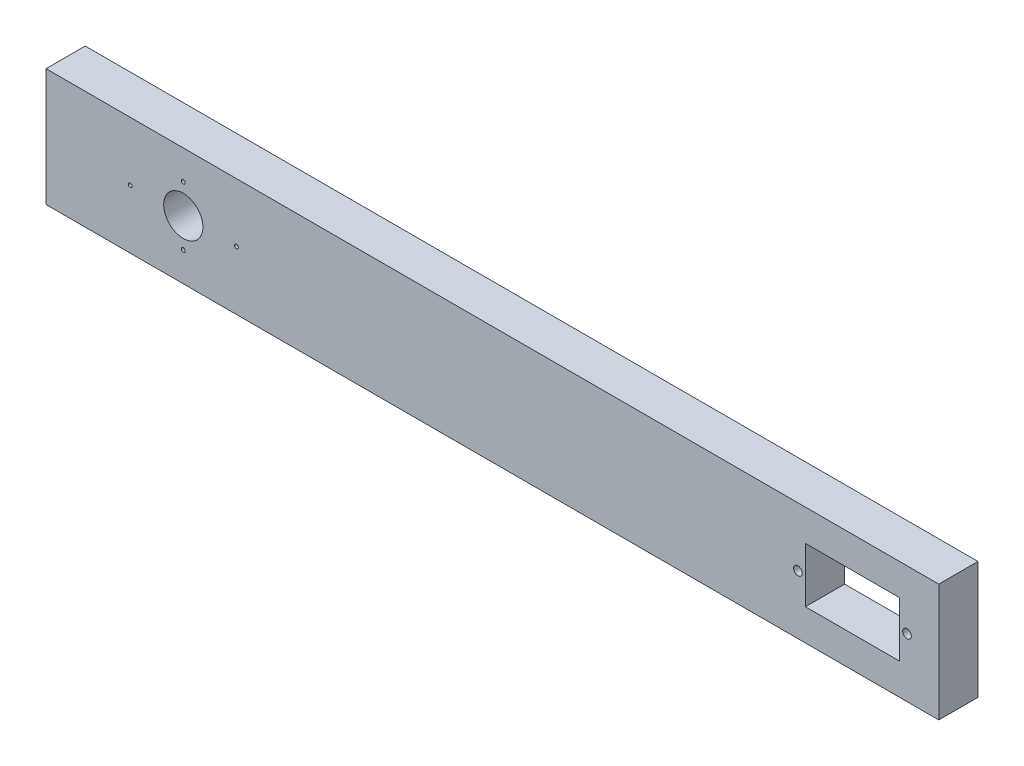
ISO-10303-21;
HEADER;
FILE_DESCRIPTION(('STEP AP214'),'2;1');
FILE_NAME('part.step','',(''),(''),'','','');
FILE_SCHEMA(('AUTOMOTIVE_DESIGN { 1 0 10303 214 1 1 1 1 }'));
ENDSEC;
DATA;
#1=APPLICATION_CONTEXT('core data for automotive mechanical design processes');
#2=APPLICATION_PROTOCOL_DEFINITION('international standard','automotive_design',2000,#1);
#3=PRODUCT_CONTEXT('',#1,'mechanical');
#4=PRODUCT('Part','Part','',(#3));
#5=PRODUCT_RELATED_PRODUCT_CATEGORY('part','',(#4));
#6=PRODUCT_DEFINITION_FORMATION('','',#4);
#7=PRODUCT_DEFINITION_CONTEXT('part definition',#1,'design');
#8=PRODUCT_DEFINITION('design','',#6,#7);
#9=PRODUCT_DEFINITION_SHAPE('','',#8);
#10=(LENGTH_UNIT() NAMED_UNIT(*) SI_UNIT(.MILLI.,.METRE.));
#11=(NAMED_UNIT(*) PLANE_ANGLE_UNIT() SI_UNIT($,.RADIAN.));
#12=(NAMED_UNIT(*) SI_UNIT($,.STERADIAN.) SOLID_ANGLE_UNIT());
#13=UNCERTAINTY_MEASURE_WITH_UNIT(LENGTH_MEASURE(1.E-05),#10,'distance_accuracy_value','');
#14=(GEOMETRIC_REPRESENTATION_CONTEXT(3) GLOBAL_UNCERTAINTY_ASSIGNED_CONTEXT((#13)) GLOBAL_UNIT_ASSIGNED_CONTEXT((#10,
#11,#12)) REPRESENTATION_CONTEXT('',''));
#15=CARTESIAN_POINT('',(0.,0.,0.));
#16=DIRECTION('',(0.,0.,1.));
#17=DIRECTION('',(1.,0.,0.));
#18=AXIS2_PLACEMENT_3D('',#15,#16,#17);
#19=CARTESIAN_POINT('',(0.,22.,10.));
#20=DIRECTION('',(0.,1.,0.));
#21=DIRECTION('',(-1.,0.,0.));
#22=AXIS2_PLACEMENT_3D('',#19,#20,#21);
#23=PLANE('',#22);
#24=DIRECTION('',(1.,0.,0.));
#25=VECTOR('',#24,1.);
#26=CARTESIAN_POINT('',(0.,22.,0.));
#27=LINE('',#26,#25);
#28=CARTESIAN_POINT('',(193.6,22.,0.));
#29=VERTEX_POINT('',#28);
#30=CARTESIAN_POINT('',(217.6,22.,0.));
#31=VERTEX_POINT('',#30);
#32=EDGE_CURVE('E166',#29,#31,#27,.T.);
#33=ORIENTED_EDGE('',*,*,#32,.T.);
#34=DIRECTION('',(0.,0.,-1.));
#35=VECTOR('',#34,1.);
#36=CARTESIAN_POINT('',(217.6,22.,10.));
#37=LINE('',#36,#35);
#38=CARTESIAN_POINT('',(217.6,22.,10.));
#39=VERTEX_POINT('',#38);
#40=EDGE_CURVE('E11',#39,#31,#37,.T.);
#41=ORIENTED_EDGE('',*,*,#40,.F.);
#42=DIRECTION('',(1.,0.,0.));
#43=VECTOR('',#42,1.);
#44=CARTESIAN_POINT('',(0.,22.,10.));
#45=LINE('',#44,#43);
#46=CARTESIAN_POINT('',(193.6,22.,10.));
#47=VERTEX_POINT('',#46);
#48=EDGE_CURVE('E117',#47,#39,#45,.T.);
#49=ORIENTED_EDGE('',*,*,#48,.F.);
#50=DIRECTION('',(0.,0.,-1.));
#51=VECTOR('',#50,1.);
#52=CARTESIAN_POINT('',(193.6,22.,10.));
#53=LINE('',#52,#51);
#54=EDGE_CURVE('E55',#47,#29,#53,.T.);
#55=ORIENTED_EDGE('',*,*,#54,.T.);
#56=EDGE_LOOP('',(#33,#41,#49,#55));
#57=FACE_BOUND('',#56,.T.);
#58=ADVANCED_FACE('F36',(#57),#23,.F.);
#59=CARTESIAN_POINT('',(217.6,0.,10.));
#60=DIRECTION('',(1.,0.,0.));
#61=DIRECTION('',(0.,0.,-1.));
#62=AXIS2_PLACEMENT_3D('',#59,#60,#61);
#63=PLANE('',#62);
#64=DIRECTION('',(0.,-1.,0.));
#65=VECTOR('',#64,1.);
#66=CARTESIAN_POINT('',(217.6,0.,0.));
#67=LINE('',#66,#65);
#68=CARTESIAN_POINT('',(217.6,8.,0.));
#69=VERTEX_POINT('',#68);
#70=EDGE_CURVE('E123',#31,#69,#67,.T.);
#71=ORIENTED_EDGE('',*,*,#70,.T.);
#72=DIRECTION('',(0.,0.,-1.));
#73=VECTOR('',#72,1.);
#74=CARTESIAN_POINT('',(217.6,8.,10.));
#75=LINE('',#74,#73);
#76=CARTESIAN_POINT('',(217.6,8.,10.));
#77=VERTEX_POINT('',#76);
#78=EDGE_CURVE('E46',#77,#69,#75,.T.);
#79=ORIENTED_EDGE('',*,*,#78,.F.);
#80=DIRECTION('',(0.,-1.,0.));
#81=VECTOR('',#80,1.);
#82=CARTESIAN_POINT('',(217.6,0.,10.));
#83=LINE('',#82,#81);
#84=EDGE_CURVE('E110',#39,#77,#83,.T.);
#85=ORIENTED_EDGE('',*,*,#84,.F.);
#86=ORIENTED_EDGE('',*,*,#40,.T.);
#87=EDGE_LOOP('',(#71,#79,#85,#86));
#88=FACE_BOUND('',#87,.T.);
#89=ADVANCED_FACE('F122',(#88),#63,.F.);
#90=CARTESIAN_POINT('',(0.,8.,10.));
#91=DIRECTION('',(0.,1.,0.));
#92=DIRECTION('',(0.,0.,1.));
#93=AXIS2_PLACEMENT_3D('',#90,#91,#92);
#94=PLANE('',#93);
#95=DIRECTION('',(1.,0.,0.));
#96=VECTOR('',#95,1.);
#97=CARTESIAN_POINT('',(0.,8.,0.));
#98=LINE('',#97,#96);
#99=CARTESIAN_POINT('',(193.6,8.,0.));
#100=VERTEX_POINT('',#99);
#101=EDGE_CURVE('E169',#100,#69,#98,.T.);
#102=ORIENTED_EDGE('',*,*,#101,.F.);
#103=DIRECTION('',(0.,0.,-1.));
#104=VECTOR('',#103,1.);
#105=CARTESIAN_POINT('',(193.6,8.,10.));
#106=LINE('',#105,#104);
#107=CARTESIAN_POINT('',(193.6,8.,10.));
#108=VERTEX_POINT('',#107);
#109=EDGE_CURVE('E81',#108,#100,#106,.T.);
#110=ORIENTED_EDGE('',*,*,#109,.F.);
#111=DIRECTION('',(1.,0.,0.));
#112=VECTOR('',#111,1.);
#113=CARTESIAN_POINT('',(0.,8.,10.));
#114=LINE('',#113,#112);
#115=EDGE_CURVE('E116',#108,#77,#114,.T.);
#116=ORIENTED_EDGE('',*,*,#115,.T.);
#117=ORIENTED_EDGE('',*,*,#78,.T.);
#118=EDGE_LOOP('',(#102,#110,#116,#117));
#119=FACE_BOUND('',#118,.T.);
#120=ADVANCED_FACE('F127',(#119),#94,.T.);
#121=CARTESIAN_POINT('',(0.,0.,10.));
#122=DIRECTION('',(0.,1.,0.));
#123=DIRECTION('',(-1.,0.,0.));
#124=AXIS2_PLACEMENT_3D('',#121,#122,#123);
#125=PLANE('',#124);
#126=DIRECTION('',(1.,0.,0.));
#127=VECTOR('',#126,1.);
#128=CARTESIAN_POINT('',(0.,0.,0.));
#129=LINE('',#128,#127);
#130=CARTESIAN_POINT('',(0.,0.,0.));
#131=VERTEX_POINT('',#130);
#132=CARTESIAN_POINT('',(227.6,0.,0.));
#133=VERTEX_POINT('',#132);
#134=EDGE_CURVE('E152',#131,#133,#129,.T.);
#135=ORIENTED_EDGE('',*,*,#134,.T.);
#136=DIRECTION('',(0.,0.,-1.));
#137=VECTOR('',#136,1.);
#138=CARTESIAN_POINT('',(227.6,0.,10.));
#139=LINE('',#138,#137);
#140=CARTESIAN_POINT('',(227.6,0.,10.));
#141=VERTEX_POINT('',#140);
#142=EDGE_CURVE('E40',#141,#133,#139,.T.);
#143=ORIENTED_EDGE('',*,*,#142,.F.);
#144=DIRECTION('',(1.,0.,0.));
#145=VECTOR('',#144,1.);
#146=CARTESIAN_POINT('',(0.,0.,10.));
#147=LINE('',#146,#145);
#148=CARTESIAN_POINT('',(0.,0.,10.));
#149=VERTEX_POINT('',#148);
#150=EDGE_CURVE('E94',#149,#141,#147,.T.);
#151=ORIENTED_EDGE('',*,*,#150,.F.);
#152=DIRECTION('',(0.,0.,-1.));
#153=VECTOR('',#152,1.);
#154=CARTESIAN_POINT('',(0.,0.,10.));
#155=LINE('',#154,#153);
#156=EDGE_CURVE('E139',#149,#131,#155,.T.);
#157=ORIENTED_EDGE('',*,*,#156,.T.);
#158=EDGE_LOOP('',(#135,#143,#151,#157));
#159=FACE_BOUND('',#158,.T.);
#160=ADVANCED_FACE('F197',(#159),#125,.F.);
#161=CARTESIAN_POINT('',(227.6,0.,10.));
#162=DIRECTION('',(1.,0.,0.));
#163=DIRECTION('',(0.,0.,-1.));
#164=AXIS2_PLACEMENT_3D('',#161,#162,#163);
#165=PLANE('',#164);
#166=DIRECTION('',(0.,-1.,0.));
#167=VECTOR('',#166,1.);
#168=CARTESIAN_POINT('',(227.6,0.,0.));
#169=LINE('',#168,#167);
#170=CARTESIAN_POINT('',(227.6,30.,0.));
#171=VERTEX_POINT('',#170);
#172=EDGE_CURVE('E155',#171,#133,#169,.T.);
#173=ORIENTED_EDGE('',*,*,#172,.F.);
#174=DIRECTION('',(0.,0.,-1.));
#175=VECTOR('',#174,1.);
#176=CARTESIAN_POINT('',(227.6,30.,10.));
#177=LINE('',#176,#175);
#178=CARTESIAN_POINT('',(227.6,30.,10.));
#179=VERTEX_POINT('',#178);
#180=EDGE_CURVE('E186',#179,#171,#177,.T.);
#181=ORIENTED_EDGE('',*,*,#180,.F.);
#182=DIRECTION('',(0.,-1.,0.));
#183=VECTOR('',#182,1.);
#184=CARTESIAN_POINT('',(227.6,0.,10.));
#185=LINE('',#184,#183);
#186=EDGE_CURVE('E194',#179,#141,#185,.T.);
#187=ORIENTED_EDGE('',*,*,#186,.T.);
#188=ORIENTED_EDGE('',*,*,#142,.T.);
#189=EDGE_LOOP('',(#173,#181,#187,#188));
#190=FACE_BOUND('',#189,.T.);
#191=ADVANCED_FACE('F193',(#190),#165,.T.);
#192=CARTESIAN_POINT('',(0.,30.,10.));
#193=DIRECTION('',(0.,1.,0.));
#194=DIRECTION('',(-1.,0.,0.));
#195=AXIS2_PLACEMENT_3D('',#192,#193,#194);
#196=PLANE('',#195);
#197=DIRECTION('',(1.,0.,0.));
#198=VECTOR('',#197,1.);
#199=CARTESIAN_POINT('',(0.,30.,0.));
#200=LINE('',#199,#198);
#201=CARTESIAN_POINT('',(0.,30.,0.));
#202=VERTEX_POINT('',#201);
#203=EDGE_CURVE('E158',#202,#171,#200,.T.);
#204=ORIENTED_EDGE('',*,*,#203,.F.);
#205=DIRECTION('',(0.,0.,-1.));
#206=VECTOR('',#205,1.);
#207=CARTESIAN_POINT('',(0.,30.,10.));
#208=LINE('',#207,#206);
#209=CARTESIAN_POINT('',(0.,30.,10.));
#210=VERTEX_POINT('',#209);
#211=EDGE_CURVE('E185',#210,#202,#208,.T.);
#212=ORIENTED_EDGE('',*,*,#211,.F.);
#213=DIRECTION('',(1.,0.,0.));
#214=VECTOR('',#213,1.);
#215=CARTESIAN_POINT('',(0.,30.,10.));
#216=LINE('',#215,#214);
#217=EDGE_CURVE('E206',#210,#179,#216,.T.);
#218=ORIENTED_EDGE('',*,*,#217,.T.);
#219=ORIENTED_EDGE('',*,*,#180,.T.);
#220=EDGE_LOOP('',(#204,#212,#218,#219));
#221=FACE_BOUND('',#220,.T.);
#222=ADVANCED_FACE('F203',(#221),#196,.T.);
#223=CARTESIAN_POINT('',(219.5,15.,10.));
#224=DIRECTION('',(0.,0.,-1.));
#225=DIRECTION('',(-1.,0.,0.));
#226=AXIS2_PLACEMENT_3D('',#223,#224,#225);
#227=CYLINDRICAL_SURFACE('',#226,1.09999999999999);
#228=CARTESIAN_POINT('',(219.5,15.,10.));
#229=DIRECTION('',(0.,0.,1.));
#230=DIRECTION('',(1.,0.,0.));
#231=AXIS2_PLACEMENT_3D('',#228,#229,#230);
#232=CIRCLE('',#231,1.09999999999999);
#233=CARTESIAN_POINT('',(220.6,15.,10.));
#234=VERTEX_POINT('',#233);
#235=EDGE_CURVE('E130',#234,#234,#232,.T.);
#236=ORIENTED_EDGE('',*,*,#235,.T.);
#237=EDGE_LOOP('',(#236));
#238=FACE_BOUND('',#237,.T.);
#239=CARTESIAN_POINT('',(219.5,15.,0.));
#240=DIRECTION('',(0.,0.,1.));
#241=DIRECTION('',(1.,0.,0.));
#242=AXIS2_PLACEMENT_3D('',#239,#240,#241);
#243=CIRCLE('',#242,1.09999999999999);
#244=CARTESIAN_POINT('',(220.6,15.,0.));
#245=VERTEX_POINT('',#244);
#246=EDGE_CURVE('E174',#245,#245,#243,.T.);
#247=ORIENTED_EDGE('',*,*,#246,.F.);
#248=EDGE_LOOP('',(#247));
#249=FACE_BOUND('',#248,.T.);
#250=ADVANCED_FACE('F262',(#238,#249),#227,.F.);
#251=CARTESIAN_POINT('',(193.6,3.8381995994184E-13,10.));
#252=DIRECTION('',(1.,0.,0.));
#253=DIRECTION('',(0.,1.,0.));
#254=AXIS2_PLACEMENT_3D('',#251,#252,#253);
#255=PLANE('',#254);
#256=DIRECTION('',(0.,-1.,0.));
#257=VECTOR('',#256,1.);
#258=CARTESIAN_POINT('',(193.6,3.8381995994184E-13,0.));
#259=LINE('',#258,#257);
#260=EDGE_CURVE('E171',#29,#100,#259,.T.);
#261=ORIENTED_EDGE('',*,*,#260,.F.);
#262=ORIENTED_EDGE('',*,*,#54,.F.);
#263=DIRECTION('',(0.,-1.,0.));
#264=VECTOR('',#263,1.);
#265=CARTESIAN_POINT('',(193.6,3.8381995994184E-13,10.));
#266=LINE('',#265,#264);
#267=EDGE_CURVE('E128',#47,#108,#266,.T.);
#268=ORIENTED_EDGE('',*,*,#267,.T.);
#269=ORIENTED_EDGE('',*,*,#109,.T.);
#270=EDGE_LOOP('',(#261,#262,#268,#269));
#271=FACE_BOUND('',#270,.T.);
#272=ADVANCED_FACE('F223',(#271),#255,.T.);
#273=CARTESIAN_POINT('',(48.53,15.,10.));
#274=DIRECTION('',(0.,0.,-1.));
#275=DIRECTION('',(-1.,0.,0.));
#276=AXIS2_PLACEMENT_3D('',#273,#274,#275);
#277=CYLINDRICAL_SURFACE('',#276,0.499999999999999);
#278=CARTESIAN_POINT('',(48.53,15.,10.));
#279=DIRECTION('',(0.,0.,1.));
#280=DIRECTION('',(1.,0.,0.));
#281=AXIS2_PLACEMENT_3D('',#278,#279,#280);
#282=CIRCLE('',#281,0.499999999999999);
#283=CARTESIAN_POINT('',(49.03,15.,10.));
#284=VERTEX_POINT('',#283);
#285=EDGE_CURVE('E210',#284,#284,#282,.F.);
#286=ORIENTED_EDGE('',*,*,#285,.F.);
#287=EDGE_LOOP('',(#286));
#288=FACE_BOUND('',#287,.T.);
#289=CARTESIAN_POINT('',(48.53,15.,0.));
#290=DIRECTION('',(0.,0.,1.));
#291=DIRECTION('',(1.,0.,0.));
#292=AXIS2_PLACEMENT_3D('',#289,#290,#291);
#293=CIRCLE('',#292,0.499999999999999);
#294=CARTESIAN_POINT('',(49.03,15.,0.));
#295=VERTEX_POINT('',#294);
#296=EDGE_CURVE('E163',#295,#295,#293,.F.);
#297=ORIENTED_EDGE('',*,*,#296,.T.);
#298=EDGE_LOOP('',(#297));
#299=FACE_BOUND('',#298,.T.);
#300=ADVANCED_FACE('F220',(#288,#299),#277,.F.);
#301=CARTESIAN_POINT('',(0.,0.,10.));
#302=DIRECTION('',(1.,0.,0.));
#303=DIRECTION('',(0.,0.,-1.));
#304=AXIS2_PLACEMENT_3D('',#301,#302,#303);
#305=PLANE('',#304);
#306=DIRECTION('',(0.,-1.,0.));
#307=VECTOR('',#306,1.);
#308=CARTESIAN_POINT('',(0.,0.,0.));
#309=LINE('',#308,#307);
#310=EDGE_CURVE('E161',#202,#131,#309,.T.);
#311=ORIENTED_EDGE('',*,*,#310,.T.);
#312=ORIENTED_EDGE('',*,*,#156,.F.);
#313=DIRECTION('',(0.,-1.,0.));
#314=VECTOR('',#313,1.);
#315=CARTESIAN_POINT('',(0.,0.,10.));
#316=LINE('',#315,#314);
#317=EDGE_CURVE('E208',#210,#149,#316,.T.);
#318=ORIENTED_EDGE('',*,*,#317,.F.);
#319=ORIENTED_EDGE('',*,*,#211,.T.);
#320=EDGE_LOOP('',(#311,#312,#318,#319));
#321=FACE_BOUND('',#320,.T.);
#322=ADVANCED_FACE('F209',(#321),#305,.F.);
#323=CARTESIAN_POINT('',(21.47,15.,10.));
#324=DIRECTION('',(0.,0.,-1.));
#325=DIRECTION('',(-1.,0.,0.));
#326=AXIS2_PLACEMENT_3D('',#323,#324,#325);
#327=CYLINDRICAL_SURFACE('',#326,0.499999999999999);
#328=CARTESIAN_POINT('',(21.47,15.,10.));
#329=DIRECTION('',(0.,0.,1.));
#330=DIRECTION('',(1.,0.,0.));
#331=AXIS2_PLACEMENT_3D('',#328,#329,#330);
#332=CIRCLE('',#331,0.499999999999999);
#333=CARTESIAN_POINT('',(21.97,15.,10.));
#334=VERTEX_POINT('',#333);
#335=EDGE_CURVE('E293',#334,#334,#332,.T.);
#336=ORIENTED_EDGE('',*,*,#335,.T.);
#337=EDGE_LOOP('',(#336));
#338=FACE_BOUND('',#337,.T.);
#339=CARTESIAN_POINT('',(21.47,15.,0.));
#340=DIRECTION('',(0.,0.,1.));
#341=DIRECTION('',(1.,0.,0.));
#342=AXIS2_PLACEMENT_3D('',#339,#340,#341);
#343=CIRCLE('',#342,0.499999999999999);
#344=CARTESIAN_POINT('',(21.97,15.,0.));
#345=VERTEX_POINT('',#344);
#346=EDGE_CURVE('E149',#345,#345,#343,.T.);
#347=ORIENTED_EDGE('',*,*,#346,.F.);
#348=EDGE_LOOP('',(#347));
#349=FACE_BOUND('',#348,.T.);
#350=ADVANCED_FACE('F259',(#338,#349),#327,.F.);
#351=CARTESIAN_POINT('',(35.,22.53,10.));
#352=DIRECTION('',(0.,0.,-1.));
#353=DIRECTION('',(-1.,0.,0.));
#354=AXIS2_PLACEMENT_3D('',#351,#352,#353);
#355=CYLINDRICAL_SURFACE('',#354,0.499999999999999);
#356=CARTESIAN_POINT('',(35.,22.53,10.));
#357=DIRECTION('',(0.,0.,1.));
#358=DIRECTION('',(1.,0.,0.));
#359=AXIS2_PLACEMENT_3D('',#356,#357,#358);
#360=CIRCLE('',#359,0.499999999999999);
#361=CARTESIAN_POINT('',(35.5,22.53,10.));
#362=VERTEX_POINT('',#361);
#363=EDGE_CURVE('E290',#362,#362,#360,.T.);
#364=ORIENTED_EDGE('',*,*,#363,.T.);
#365=EDGE_LOOP('',(#364));
#366=FACE_BOUND('',#365,.T.);
#367=CARTESIAN_POINT('',(35.,22.53,0.));
#368=DIRECTION('',(0.,0.,1.));
#369=DIRECTION('',(1.,0.,0.));
#370=AXIS2_PLACEMENT_3D('',#367,#368,#369);
#371=CIRCLE('',#370,0.499999999999999);
#372=CARTESIAN_POINT('',(35.5,22.53,0.));
#373=VERTEX_POINT('',#372);
#374=EDGE_CURVE('E146',#373,#373,#371,.T.);
#375=ORIENTED_EDGE('',*,*,#374,.F.);
#376=EDGE_LOOP('',(#375));
#377=FACE_BOUND('',#376,.T.);
#378=ADVANCED_FACE('F269',(#366,#377),#355,.F.);
#379=CARTESIAN_POINT('',(35.,7.47,10.));
#380=DIRECTION('',(0.,0.,-1.));
#381=DIRECTION('',(-1.,0.,0.));
#382=AXIS2_PLACEMENT_3D('',#379,#380,#381);
#383=CYLINDRICAL_SURFACE('',#382,0.499999999999999);
#384=CARTESIAN_POINT('',(35.,7.47,10.));
#385=DIRECTION('',(0.,0.,1.));
#386=DIRECTION('',(1.,0.,0.));
#387=AXIS2_PLACEMENT_3D('',#384,#385,#386);
#388=CIRCLE('',#387,0.499999999999999);
#389=CARTESIAN_POINT('',(35.5,7.47,10.));
#390=VERTEX_POINT('',#389);
#391=EDGE_CURVE('E280',#390,#390,#388,.F.);
#392=ORIENTED_EDGE('',*,*,#391,.F.);
#393=EDGE_LOOP('',(#392));
#394=FACE_BOUND('',#393,.T.);
#395=CARTESIAN_POINT('',(35.,7.47,0.));
#396=DIRECTION('',(0.,0.,1.));
#397=DIRECTION('',(1.,0.,0.));
#398=AXIS2_PLACEMENT_3D('',#395,#396,#397);
#399=CIRCLE('',#398,0.499999999999999);
#400=CARTESIAN_POINT('',(35.5,7.47,0.));
#401=VERTEX_POINT('',#400);
#402=EDGE_CURVE('E143',#401,#401,#399,.F.);
#403=ORIENTED_EDGE('',*,*,#402,.T.);
#404=EDGE_LOOP('',(#403));
#405=FACE_BOUND('',#404,.T.);
#406=ADVANCED_FACE('F245',(#394,#405),#383,.F.);
#407=CARTESIAN_POINT('',(35.,15.,10.));
#408=DIRECTION('',(0.,0.,-1.));
#409=DIRECTION('',(-1.,0.,0.));
#410=AXIS2_PLACEMENT_3D('',#407,#408,#409);
#411=CYLINDRICAL_SURFACE('',#410,5.);
#412=CARTESIAN_POINT('',(35.,15.,10.));
#413=DIRECTION('',(0.,0.,1.));
#414=DIRECTION('',(1.,0.,0.));
#415=AXIS2_PLACEMENT_3D('',#412,#413,#414);
#416=CIRCLE('',#415,5.);
#417=CARTESIAN_POINT('',(40.,15.,10.));
#418=VERTEX_POINT('',#417);
#419=EDGE_CURVE('E180',#418,#418,#416,.T.);
#420=ORIENTED_EDGE('',*,*,#419,.T.);
#421=EDGE_LOOP('',(#420));
#422=FACE_BOUND('',#421,.T.);
#423=CARTESIAN_POINT('',(35.,15.,0.));
#424=DIRECTION('',(0.,0.,1.));
#425=DIRECTION('',(1.,0.,0.));
#426=AXIS2_PLACEMENT_3D('',#423,#424,#425);
#427=CIRCLE('',#426,5.);
#428=CARTESIAN_POINT('',(40.,15.,0.));
#429=VERTEX_POINT('',#428);
#430=EDGE_CURVE('E140',#429,#429,#427,.T.);
#431=ORIENTED_EDGE('',*,*,#430,.F.);
#432=EDGE_LOOP('',(#431));
#433=FACE_BOUND('',#432,.T.);
#434=ADVANCED_FACE('F38',(#422,#433),#411,.F.);
#435=CARTESIAN_POINT('',(191.7,15.,10.));
#436=DIRECTION('',(0.,0.,-1.));
#437=DIRECTION('',(-1.,0.,0.));
#438=AXIS2_PLACEMENT_3D('',#435,#436,#437);
#439=CYLINDRICAL_SURFACE('',#438,1.09999999999999);
#440=CARTESIAN_POINT('',(191.7,15.,10.));
#441=DIRECTION('',(0.,0.,1.));
#442=DIRECTION('',(1.,0.,0.));
#443=AXIS2_PLACEMENT_3D('',#440,#441,#442);
#444=CIRCLE('',#443,1.09999999999999);
#445=CARTESIAN_POINT('',(192.8,15.,10.));
#446=VERTEX_POINT('',#445);
#447=EDGE_CURVE('E136',#446,#446,#444,.F.);
#448=ORIENTED_EDGE('',*,*,#447,.F.);
#449=EDGE_LOOP('',(#448));
#450=FACE_BOUND('',#449,.T.);
#451=CARTESIAN_POINT('',(191.7,15.,0.));
#452=DIRECTION('',(0.,0.,1.));
#453=DIRECTION('',(1.,0.,0.));
#454=AXIS2_PLACEMENT_3D('',#451,#452,#453);
#455=CIRCLE('',#454,1.09999999999999);
#456=CARTESIAN_POINT('',(192.8,15.,0.));
#457=VERTEX_POINT('',#456);
#458=EDGE_CURVE('E177',#457,#457,#455,.F.);
#459=ORIENTED_EDGE('',*,*,#458,.T.);
#460=EDGE_LOOP('',(#459));
#461=FACE_BOUND('',#460,.T.);
#462=ADVANCED_FACE('F235',(#450,#461),#439,.F.);
#463=CARTESIAN_POINT('',(0.,0.,10.));
#464=DIRECTION('',(0.,0.,1.));
#465=DIRECTION('',(1.,0.,0.));
#466=AXIS2_PLACEMENT_3D('',#463,#464,#465);
#467=PLANE('',#466);
#468=ORIENTED_EDGE('',*,*,#419,.F.);
#469=EDGE_LOOP('',(#468));
#470=FACE_BOUND('',#469,.T.);
#471=ORIENTED_EDGE('',*,*,#391,.T.);
#472=EDGE_LOOP('',(#471));
#473=FACE_BOUND('',#472,.T.);
#474=ORIENTED_EDGE('',*,*,#363,.F.);
#475=EDGE_LOOP('',(#474));
#476=FACE_BOUND('',#475,.T.);
#477=ORIENTED_EDGE('',*,*,#335,.F.);
#478=EDGE_LOOP('',(#477));
#479=FACE_BOUND('',#478,.T.);
#480=ORIENTED_EDGE('',*,*,#150,.T.);
#481=ORIENTED_EDGE('',*,*,#186,.F.);
#482=ORIENTED_EDGE('',*,*,#217,.F.);
#483=ORIENTED_EDGE('',*,*,#317,.T.);
#484=EDGE_LOOP('',(#480,#481,#482,#483));
#485=FACE_BOUND('',#484,.T.);
#486=ORIENTED_EDGE('',*,*,#285,.T.);
#487=EDGE_LOOP('',(#486));
#488=FACE_BOUND('',#487,.T.);
#489=ORIENTED_EDGE('',*,*,#48,.T.);
#490=ORIENTED_EDGE('',*,*,#84,.T.);
#491=ORIENTED_EDGE('',*,*,#115,.F.);
#492=ORIENTED_EDGE('',*,*,#267,.F.);
#493=EDGE_LOOP('',(#489,#490,#491,#492));
#494=FACE_BOUND('',#493,.T.);
#495=ORIENTED_EDGE('',*,*,#235,.F.);
#496=EDGE_LOOP('',(#495));
#497=FACE_BOUND('',#496,.T.);
#498=ORIENTED_EDGE('',*,*,#447,.T.);
#499=EDGE_LOOP('',(#498));
#500=FACE_BOUND('',#499,.T.);
#501=ADVANCED_FACE('F112',(#470,#473,#476,#479,#485,#488,#494,#497,#500),#467,.T.);
#502=CARTESIAN_POINT('',(0.,0.,0.));
#503=DIRECTION('',(0.,0.,1.));
#504=DIRECTION('',(1.,0.,0.));
#505=AXIS2_PLACEMENT_3D('',#502,#503,#504);
#506=PLANE('',#505);
#507=ORIENTED_EDGE('',*,*,#430,.T.);
#508=EDGE_LOOP('',(#507));
#509=FACE_BOUND('',#508,.T.);
#510=ORIENTED_EDGE('',*,*,#402,.F.);
#511=EDGE_LOOP('',(#510));
#512=FACE_BOUND('',#511,.T.);
#513=ORIENTED_EDGE('',*,*,#374,.T.);
#514=EDGE_LOOP('',(#513));
#515=FACE_BOUND('',#514,.T.);
#516=ORIENTED_EDGE('',*,*,#346,.T.);
#517=EDGE_LOOP('',(#516));
#518=FACE_BOUND('',#517,.T.);
#519=ORIENTED_EDGE('',*,*,#134,.F.);
#520=ORIENTED_EDGE('',*,*,#310,.F.);
#521=ORIENTED_EDGE('',*,*,#203,.T.);
#522=ORIENTED_EDGE('',*,*,#172,.T.);
#523=EDGE_LOOP('',(#519,#520,#521,#522));
#524=FACE_BOUND('',#523,.T.);
#525=ORIENTED_EDGE('',*,*,#296,.F.);
#526=EDGE_LOOP('',(#525));
#527=FACE_BOUND('',#526,.T.);
#528=ORIENTED_EDGE('',*,*,#32,.F.);
#529=ORIENTED_EDGE('',*,*,#260,.T.);
#530=ORIENTED_EDGE('',*,*,#101,.T.);
#531=ORIENTED_EDGE('',*,*,#70,.F.);
#532=EDGE_LOOP('',(#528,#529,#530,#531));
#533=FACE_BOUND('',#532,.T.);
#534=ORIENTED_EDGE('',*,*,#246,.T.);
#535=EDGE_LOOP('',(#534));
#536=FACE_BOUND('',#535,.T.);
#537=ORIENTED_EDGE('',*,*,#458,.F.);
#538=EDGE_LOOP('',(#537));
#539=FACE_BOUND('',#538,.T.);
#540=ADVANCED_FACE('F201',(#509,#512,#515,#518,#524,#527,#533,#536,#539),#506,.F.);
#541=CLOSED_SHELL('',(#58,#89,#120,#160,#191,#222,#250,#272,#300,#322,#350,#378,#406,#434,#462,
#501,#540));
#542=MANIFOLD_SOLID_BREP('B2',#541);
#543=ADVANCED_BREP_SHAPE_REPRESENTATION('',(#18,#542),#14);
#544=SHAPE_DEFINITION_REPRESENTATION(#9,#543);
ENDSEC;
END-ISO-10303-21;
